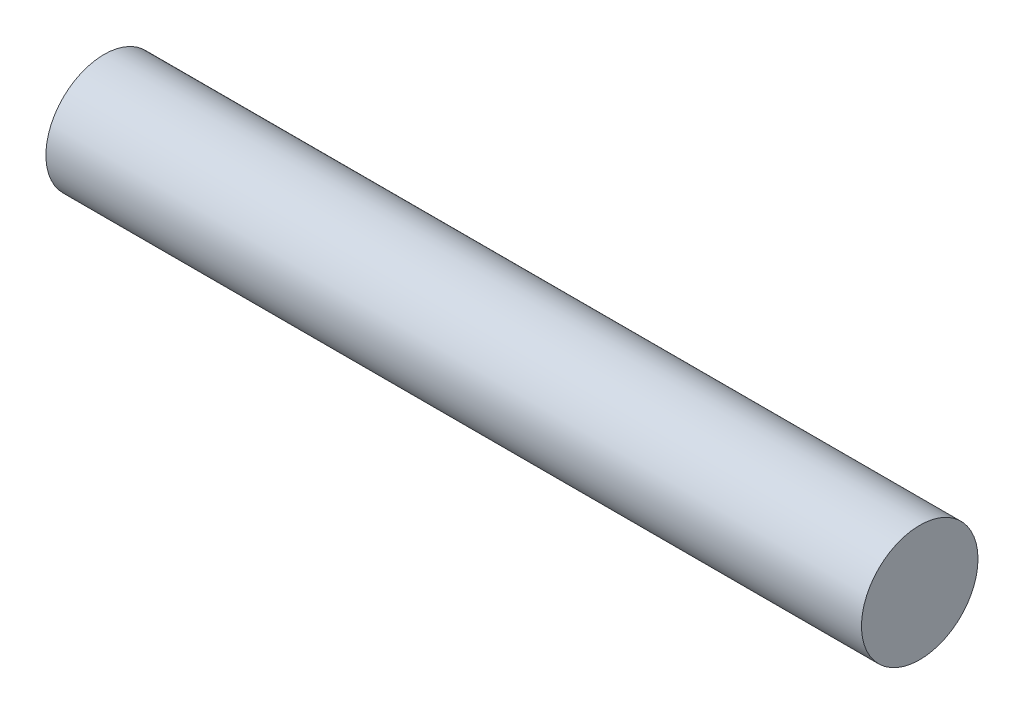
ISO-10303-21;
HEADER;
FILE_DESCRIPTION(('STEP AP214'),'2;1');
FILE_NAME('part.step','',(''),(''),'','','');
FILE_SCHEMA(('AUTOMOTIVE_DESIGN { 1 0 10303 214 1 1 1 1 }'));
ENDSEC;
DATA;
#1=APPLICATION_CONTEXT('core data for automotive mechanical design processes');
#2=APPLICATION_PROTOCOL_DEFINITION('international standard','automotive_design',2000,#1);
#3=PRODUCT_CONTEXT('',#1,'mechanical');
#4=PRODUCT('Part','Part','',(#3));
#5=PRODUCT_RELATED_PRODUCT_CATEGORY('part','',(#4));
#6=PRODUCT_DEFINITION_FORMATION('','',#4);
#7=PRODUCT_DEFINITION_CONTEXT('part definition',#1,'design');
#8=PRODUCT_DEFINITION('design','',#6,#7);
#9=PRODUCT_DEFINITION_SHAPE('','',#8);
#10=(LENGTH_UNIT() NAMED_UNIT(*) SI_UNIT(.MILLI.,.METRE.));
#11=(NAMED_UNIT(*) PLANE_ANGLE_UNIT() SI_UNIT($,.RADIAN.));
#12=(NAMED_UNIT(*) SI_UNIT($,.STERADIAN.) SOLID_ANGLE_UNIT());
#13=UNCERTAINTY_MEASURE_WITH_UNIT(LENGTH_MEASURE(1.E-05),#10,'distance_accuracy_value','');
#14=(GEOMETRIC_REPRESENTATION_CONTEXT(3) GLOBAL_UNCERTAINTY_ASSIGNED_CONTEXT((#13)) GLOBAL_UNIT_ASSIGNED_CONTEXT((#10,
#11,#12)) REPRESENTATION_CONTEXT('',''));
#15=CARTESIAN_POINT('',(0.,0.,0.));
#16=DIRECTION('',(0.,0.,1.));
#17=DIRECTION('',(1.,0.,0.));
#18=AXIS2_PLACEMENT_3D('',#15,#16,#17);
#19=CARTESIAN_POINT('',(133.35,0.,0.));
#20=DIRECTION('',(-1.,0.,0.));
#21=DIRECTION('',(0.,0.,1.));
#22=AXIS2_PLACEMENT_3D('',#19,#20,#21);
#23=CYLINDRICAL_SURFACE('',#22,19.05);
#24=CARTESIAN_POINT('',(133.35,0.,0.));
#25=DIRECTION('',(1.,0.,0.));
#26=DIRECTION('',(0.,0.,-1.));
#27=AXIS2_PLACEMENT_3D('',#24,#25,#26);
#28=CIRCLE('',#27,19.05);
#29=CARTESIAN_POINT('',(133.35,0.,-19.05));
#30=VERTEX_POINT('',#29);
#31=EDGE_CURVE('E10',#30,#30,#28,.T.);
#32=ORIENTED_EDGE('',*,*,#31,.F.);
#33=EDGE_LOOP('',(#32));
#34=FACE_BOUND('',#33,.T.);
#35=CARTESIAN_POINT('',(-133.35,0.,0.));
#36=DIRECTION('',(1.,0.,0.));
#37=DIRECTION('',(0.,0.,-1.));
#38=AXIS2_PLACEMENT_3D('',#35,#36,#37);
#39=CIRCLE('',#38,19.05);
#40=CARTESIAN_POINT('',(-133.35,0.,-19.05));
#41=VERTEX_POINT('',#40);
#42=EDGE_CURVE('E33',#41,#41,#39,.T.);
#43=ORIENTED_EDGE('',*,*,#42,.T.);
#44=EDGE_LOOP('',(#43));
#45=FACE_BOUND('',#44,.T.);
#46=ADVANCED_FACE('F30',(#34,#45),#23,.T.);
#47=CARTESIAN_POINT('',(133.35,0.,0.));
#48=DIRECTION('',(1.,0.,0.));
#49=DIRECTION('',(0.,0.,-1.));
#50=AXIS2_PLACEMENT_3D('',#47,#48,#49);
#51=PLANE('',#50);
#52=ORIENTED_EDGE('',*,*,#31,.T.);
#53=EDGE_LOOP('',(#52));
#54=FACE_BOUND('',#53,.T.);
#55=ADVANCED_FACE('F45',(#54),#51,.T.);
#56=CARTESIAN_POINT('',(-133.35,0.,0.));
#57=DIRECTION('',(1.,0.,0.));
#58=DIRECTION('',(0.,0.,-1.));
#59=AXIS2_PLACEMENT_3D('',#56,#57,#58);
#60=PLANE('',#59);
#61=ORIENTED_EDGE('',*,*,#42,.F.);
#62=EDGE_LOOP('',(#61));
#63=FACE_BOUND('',#62,.T.);
#64=ADVANCED_FACE('F43',(#63),#60,.F.);
#65=CLOSED_SHELL('',(#46,#55,#64));
#66=MANIFOLD_SOLID_BREP('B2',#65);
#67=ADVANCED_BREP_SHAPE_REPRESENTATION('',(#18,#66),#14);
#68=SHAPE_DEFINITION_REPRESENTATION(#9,#67);
ENDSEC;
END-ISO-10303-21;
